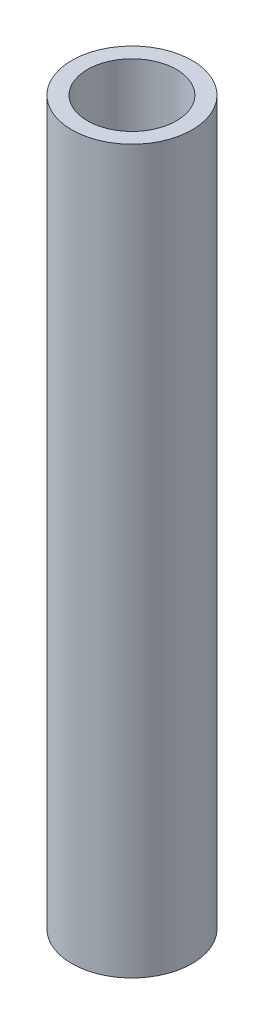
ISO-10303-21;
HEADER;
FILE_DESCRIPTION(('STEP AP214'),'2;1');
FILE_NAME('part.step','',(''),(''),'','','');
FILE_SCHEMA(('AUTOMOTIVE_DESIGN { 1 0 10303 214 1 1 1 1 }'));
ENDSEC;
DATA;
#1=APPLICATION_CONTEXT('core data for automotive mechanical design processes');
#2=APPLICATION_PROTOCOL_DEFINITION('international standard','automotive_design',2000,#1);
#3=PRODUCT_CONTEXT('',#1,'mechanical');
#4=PRODUCT('Part','Part','',(#3));
#5=PRODUCT_RELATED_PRODUCT_CATEGORY('part','',(#4));
#6=PRODUCT_DEFINITION_FORMATION('','',#4);
#7=PRODUCT_DEFINITION_CONTEXT('part definition',#1,'design');
#8=PRODUCT_DEFINITION('design','',#6,#7);
#9=PRODUCT_DEFINITION_SHAPE('','',#8);
#10=(LENGTH_UNIT() NAMED_UNIT(*) SI_UNIT(.MILLI.,.METRE.));
#11=(NAMED_UNIT(*) PLANE_ANGLE_UNIT() SI_UNIT($,.RADIAN.));
#12=(NAMED_UNIT(*) SI_UNIT($,.STERADIAN.) SOLID_ANGLE_UNIT());
#13=UNCERTAINTY_MEASURE_WITH_UNIT(LENGTH_MEASURE(1.E-05),#10,'distance_accuracy_value','');
#14=(GEOMETRIC_REPRESENTATION_CONTEXT(3) GLOBAL_UNCERTAINTY_ASSIGNED_CONTEXT((#13)) GLOBAL_UNIT_ASSIGNED_CONTEXT((#10,
#11,#12)) REPRESENTATION_CONTEXT('',''));
#15=CARTESIAN_POINT('',(0.,0.,0.));
#16=DIRECTION('',(0.,0.,1.));
#17=DIRECTION('',(1.,0.,0.));
#18=AXIS2_PLACEMENT_3D('',#15,#16,#17);
#19=CARTESIAN_POINT('',(0.,76.2,0.));
#20=DIRECTION('',(0.,1.,0.));
#21=DIRECTION('',(0.,0.,1.));
#22=AXIS2_PLACEMENT_3D('',#19,#20,#21);
#23=PLANE('',#22);
#24=CARTESIAN_POINT('',(0.,76.2,0.));
#25=DIRECTION('',(0.,1.,0.));
#26=DIRECTION('',(0.,0.,1.));
#27=AXIS2_PLACEMENT_3D('',#24,#25,#26);
#28=CIRCLE('',#27,6.35);
#29=CARTESIAN_POINT('',(0.,76.2,6.35));
#30=VERTEX_POINT('',#29);
#31=EDGE_CURVE('E12',#30,#30,#28,.T.);
#32=ORIENTED_EDGE('',*,*,#31,.T.);
#33=EDGE_LOOP('',(#32));
#34=FACE_BOUND('',#33,.T.);
#35=CARTESIAN_POINT('',(0.,76.2,0.));
#36=DIRECTION('',(0.,1.,0.));
#37=DIRECTION('',(0.,0.,1.));
#38=AXIS2_PLACEMENT_3D('',#35,#36,#37);
#39=CIRCLE('',#38,4.699);
#40=CARTESIAN_POINT('',(0.,76.2,4.699));
#41=VERTEX_POINT('',#40);
#42=EDGE_CURVE('E54',#41,#41,#39,.T.);
#43=ORIENTED_EDGE('',*,*,#42,.F.);
#44=EDGE_LOOP('',(#43));
#45=FACE_BOUND('',#44,.T.);
#46=ADVANCED_FACE('F43',(#34,#45),#23,.T.);
#47=CARTESIAN_POINT('',(0.,0.,0.));
#48=DIRECTION('',(0.,1.,0.));
#49=DIRECTION('',(0.,0.,1.));
#50=AXIS2_PLACEMENT_3D('',#47,#48,#49);
#51=PLANE('',#50);
#52=CARTESIAN_POINT('',(0.,0.,0.));
#53=DIRECTION('',(0.,1.,0.));
#54=DIRECTION('',(0.,0.,1.));
#55=AXIS2_PLACEMENT_3D('',#52,#53,#54);
#56=CIRCLE('',#55,6.35);
#57=CARTESIAN_POINT('',(0.,0.,6.35));
#58=VERTEX_POINT('',#57);
#59=EDGE_CURVE('E47',#58,#58,#56,.T.);
#60=ORIENTED_EDGE('',*,*,#59,.F.);
#61=EDGE_LOOP('',(#60));
#62=FACE_BOUND('',#61,.T.);
#63=CARTESIAN_POINT('',(0.,0.,0.));
#64=DIRECTION('',(0.,1.,0.));
#65=DIRECTION('',(0.,0.,1.));
#66=AXIS2_PLACEMENT_3D('',#63,#64,#65);
#67=CIRCLE('',#66,4.699);
#68=CARTESIAN_POINT('',(0.,0.,4.699));
#69=VERTEX_POINT('',#68);
#70=EDGE_CURVE('E56',#69,#69,#67,.T.);
#71=ORIENTED_EDGE('',*,*,#70,.T.);
#72=EDGE_LOOP('',(#71));
#73=FACE_BOUND('',#72,.T.);
#74=ADVANCED_FACE('F66',(#62,#73),#51,.F.);
#75=CARTESIAN_POINT('',(0.,76.2,0.));
#76=DIRECTION('',(0.,-1.,0.));
#77=DIRECTION('',(0.,0.,-1.));
#78=AXIS2_PLACEMENT_3D('',#75,#76,#77);
#79=CYLINDRICAL_SURFACE('',#78,6.35);
#80=ORIENTED_EDGE('',*,*,#31,.F.);
#81=EDGE_LOOP('',(#80));
#82=FACE_BOUND('',#81,.T.);
#83=ORIENTED_EDGE('',*,*,#59,.T.);
#84=EDGE_LOOP('',(#83));
#85=FACE_BOUND('',#84,.T.);
#86=ADVANCED_FACE('F45',(#82,#85),#79,.T.);
#87=CARTESIAN_POINT('',(0.,76.2,0.));
#88=DIRECTION('',(0.,-1.,0.));
#89=DIRECTION('',(0.,0.,-1.));
#90=AXIS2_PLACEMENT_3D('',#87,#88,#89);
#91=CYLINDRICAL_SURFACE('',#90,4.699);
#92=ORIENTED_EDGE('',*,*,#42,.T.);
#93=EDGE_LOOP('',(#92));
#94=FACE_BOUND('',#93,.T.);
#95=ORIENTED_EDGE('',*,*,#70,.F.);
#96=EDGE_LOOP('',(#95));
#97=FACE_BOUND('',#96,.T.);
#98=ADVANCED_FACE('F62',(#94,#97),#91,.F.);
#99=CLOSED_SHELL('',(#46,#74,#86,#98));
#100=MANIFOLD_SOLID_BREP('B2',#99);
#101=ADVANCED_BREP_SHAPE_REPRESENTATION('',(#18,#100),#14);
#102=SHAPE_DEFINITION_REPRESENTATION(#9,#101);
ENDSEC;
END-ISO-10303-21;
